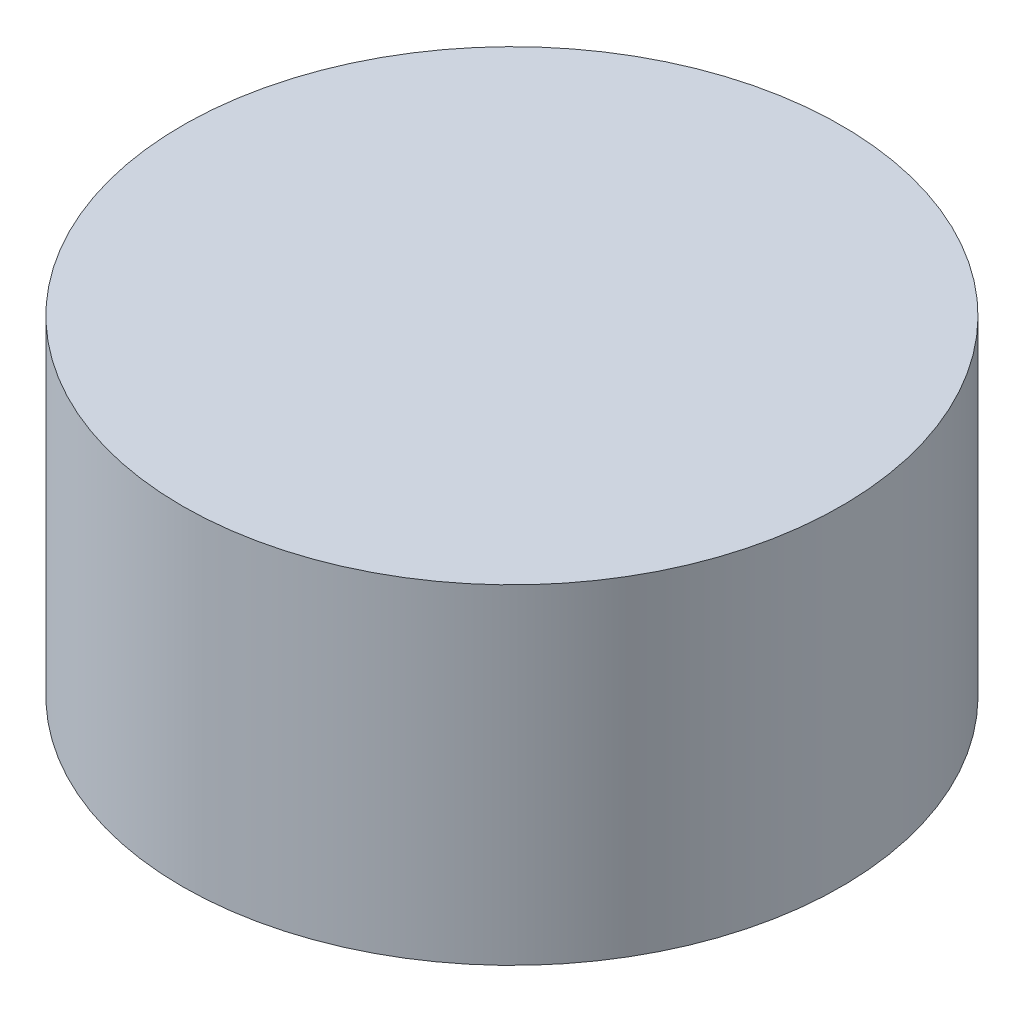
ISO-10303-21;
HEADER;
FILE_DESCRIPTION(('STEP AP214'),'2;1');
FILE_NAME('part.step','',(''),(''),'','','');
FILE_SCHEMA(('AUTOMOTIVE_DESIGN { 1 0 10303 214 1 1 1 1 }'));
ENDSEC;
DATA;
#1=APPLICATION_CONTEXT('core data for automotive mechanical design processes');
#2=APPLICATION_PROTOCOL_DEFINITION('international standard','automotive_design',2000,#1);
#3=PRODUCT_CONTEXT('',#1,'mechanical');
#4=PRODUCT('Part','Part','',(#3));
#5=PRODUCT_RELATED_PRODUCT_CATEGORY('part','',(#4));
#6=PRODUCT_DEFINITION_FORMATION('','',#4);
#7=PRODUCT_DEFINITION_CONTEXT('part definition',#1,'design');
#8=PRODUCT_DEFINITION('design','',#6,#7);
#9=PRODUCT_DEFINITION_SHAPE('','',#8);
#10=(LENGTH_UNIT() NAMED_UNIT(*) SI_UNIT(.MILLI.,.METRE.));
#11=(NAMED_UNIT(*) PLANE_ANGLE_UNIT() SI_UNIT($,.RADIAN.));
#12=(NAMED_UNIT(*) SI_UNIT($,.STERADIAN.) SOLID_ANGLE_UNIT());
#13=UNCERTAINTY_MEASURE_WITH_UNIT(LENGTH_MEASURE(1.E-05),#10,'distance_accuracy_value','');
#14=(GEOMETRIC_REPRESENTATION_CONTEXT(3) GLOBAL_UNCERTAINTY_ASSIGNED_CONTEXT((#13)) GLOBAL_UNIT_ASSIGNED_CONTEXT((#10,
#11,#12)) REPRESENTATION_CONTEXT('',''));
#15=CARTESIAN_POINT('',(0.,0.,0.));
#16=DIRECTION('',(0.,0.,1.));
#17=DIRECTION('',(1.,0.,0.));
#18=AXIS2_PLACEMENT_3D('',#15,#16,#17);
#19=CARTESIAN_POINT('',(0.,1.,0.));
#20=DIRECTION('',(0.,-1.,0.));
#21=DIRECTION('',(0.,0.,-1.));
#22=AXIS2_PLACEMENT_3D('',#19,#20,#21);
#23=CYLINDRICAL_SURFACE('',#22,1.);
#24=CARTESIAN_POINT('',(0.,1.,0.));
#25=DIRECTION('',(0.,1.,0.));
#26=DIRECTION('',(0.,0.,1.));
#27=AXIS2_PLACEMENT_3D('',#24,#25,#26);
#28=CIRCLE('',#27,1.);
#29=CARTESIAN_POINT('',(0.,1.,1.));
#30=VERTEX_POINT('',#29);
#31=EDGE_CURVE('E10',#30,#30,#28,.T.);
#32=ORIENTED_EDGE('',*,*,#31,.F.);
#33=EDGE_LOOP('',(#32));
#34=FACE_BOUND('',#33,.T.);
#35=CARTESIAN_POINT('',(0.,0.,0.));
#36=DIRECTION('',(0.,1.,0.));
#37=DIRECTION('',(0.,0.,1.));
#38=AXIS2_PLACEMENT_3D('',#35,#36,#37);
#39=CIRCLE('',#38,1.);
#40=CARTESIAN_POINT('',(0.,0.,1.));
#41=VERTEX_POINT('',#40);
#42=EDGE_CURVE('E44',#41,#41,#39,.T.);
#43=ORIENTED_EDGE('',*,*,#42,.T.);
#44=EDGE_LOOP('',(#43));
#45=FACE_BOUND('',#44,.T.);
#46=ADVANCED_FACE('F41',(#34,#45),#23,.T.);
#47=CARTESIAN_POINT('',(0.,1.,0.));
#48=DIRECTION('',(0.,1.,0.));
#49=DIRECTION('',(0.,0.,1.));
#50=AXIS2_PLACEMENT_3D('',#47,#48,#49);
#51=PLANE('',#50);
#52=ORIENTED_EDGE('',*,*,#31,.T.);
#53=EDGE_LOOP('',(#52));
#54=FACE_BOUND('',#53,.T.);
#55=ADVANCED_FACE('F58',(#54),#51,.T.);
#56=CARTESIAN_POINT('',(0.,0.,0.));
#57=DIRECTION('',(0.,1.,0.));
#58=DIRECTION('',(0.,0.,1.));
#59=AXIS2_PLACEMENT_3D('',#56,#57,#58);
#60=PLANE('',#59);
#61=ORIENTED_EDGE('',*,*,#42,.F.);
#62=EDGE_LOOP('',(#61));
#63=FACE_BOUND('',#62,.T.);
#64=ADVANCED_FACE('F56',(#63),#60,.F.);
#65=CLOSED_SHELL('',(#46,#55,#64));
#66=MANIFOLD_SOLID_BREP('B2',#65);
#67=ADVANCED_BREP_SHAPE_REPRESENTATION('',(#18,#66),#14);
#68=SHAPE_DEFINITION_REPRESENTATION(#9,#67);
ENDSEC;
END-ISO-10303-21;
